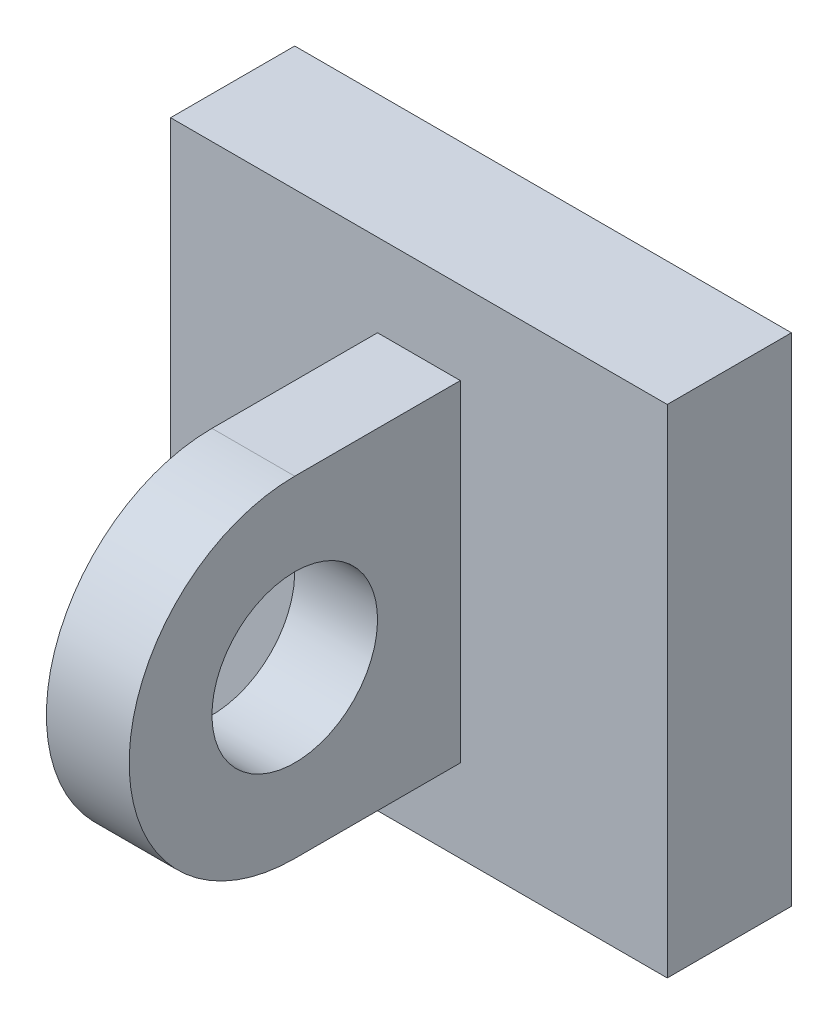
ISO-10303-21;
HEADER;
FILE_DESCRIPTION(('STEP AP214'),'2;1');
FILE_NAME('part.step','',(''),(''),'','','');
FILE_SCHEMA(('AUTOMOTIVE_DESIGN { 1 0 10303 214 1 1 1 1 }'));
ENDSEC;
DATA;
#1=APPLICATION_CONTEXT('core data for automotive mechanical design processes');
#2=APPLICATION_PROTOCOL_DEFINITION('international standard','automotive_design',2000,#1);
#3=PRODUCT_CONTEXT('',#1,'mechanical');
#4=PRODUCT('Part','Part','',(#3));
#5=PRODUCT_RELATED_PRODUCT_CATEGORY('part','',(#4));
#6=PRODUCT_DEFINITION_FORMATION('','',#4);
#7=PRODUCT_DEFINITION_CONTEXT('part definition',#1,'design');
#8=PRODUCT_DEFINITION('design','',#6,#7);
#9=PRODUCT_DEFINITION_SHAPE('','',#8);
#10=(LENGTH_UNIT() NAMED_UNIT(*) SI_UNIT(.MILLI.,.METRE.));
#11=(NAMED_UNIT(*) PLANE_ANGLE_UNIT() SI_UNIT($,.RADIAN.));
#12=(NAMED_UNIT(*) SI_UNIT($,.STERADIAN.) SOLID_ANGLE_UNIT());
#13=UNCERTAINTY_MEASURE_WITH_UNIT(LENGTH_MEASURE(1.E-05),#10,'distance_accuracy_value','');
#14=(GEOMETRIC_REPRESENTATION_CONTEXT(3) GLOBAL_UNCERTAINTY_ASSIGNED_CONTEXT((#13)) GLOBAL_UNIT_ASSIGNED_CONTEXT((#10,
#11,#12)) REPRESENTATION_CONTEXT('',''));
#15=CARTESIAN_POINT('',(0.,0.,0.));
#16=DIRECTION('',(0.,0.,1.));
#17=DIRECTION('',(1.,0.,0.));
#18=AXIS2_PLACEMENT_3D('',#15,#16,#17);
#19=CARTESIAN_POINT('',(0.,0.,7.5));
#20=DIRECTION('',(0.,0.,1.));
#21=DIRECTION('',(1.,0.,0.));
#22=AXIS2_PLACEMENT_3D('',#19,#20,#21);
#23=PLANE('',#22);
#24=DIRECTION('',(0.,1.,0.));
#25=VECTOR('',#24,1.);
#26=CARTESIAN_POINT('',(30.,30.,7.5));
#27=LINE('',#26,#25);
#28=CARTESIAN_POINT('',(30.,-30.,7.5));
#29=VERTEX_POINT('',#28);
#30=CARTESIAN_POINT('',(30.,30.,7.5));
#31=VERTEX_POINT('',#30);
#32=EDGE_CURVE('E155',#29,#31,#27,.T.);
#33=ORIENTED_EDGE('',*,*,#32,.T.);
#34=DIRECTION('',(-1.,0.,0.));
#35=VECTOR('',#34,1.);
#36=CARTESIAN_POINT('',(-30.,30.,7.5));
#37=LINE('',#36,#35);
#38=CARTESIAN_POINT('',(-30.,30.,7.5));
#39=VERTEX_POINT('',#38);
#40=EDGE_CURVE('E94',#31,#39,#37,.T.);
#41=ORIENTED_EDGE('',*,*,#40,.T.);
#42=DIRECTION('',(0.,-1.,0.));
#43=VECTOR('',#42,1.);
#44=CARTESIAN_POINT('',(-30.,30.,7.5));
#45=LINE('',#44,#43);
#46=CARTESIAN_POINT('',(-30.,-30.,7.5));
#47=VERTEX_POINT('',#46);
#48=EDGE_CURVE('E160',#39,#47,#45,.T.);
#49=ORIENTED_EDGE('',*,*,#48,.T.);
#50=DIRECTION('',(1.,0.,0.));
#51=VECTOR('',#50,1.);
#52=CARTESIAN_POINT('',(-30.,-30.,7.5));
#53=LINE('',#52,#51);
#54=EDGE_CURVE('E66',#47,#29,#53,.T.);
#55=ORIENTED_EDGE('',*,*,#54,.T.);
#56=EDGE_LOOP('',(#33,#41,#49,#55));
#57=FACE_BOUND('',#56,.T.);
#58=DIRECTION('',(-1.,0.,0.));
#59=VECTOR('',#58,1.);
#60=CARTESIAN_POINT('',(5.,-20.,7.5));
#61=LINE('',#60,#59);
#62=CARTESIAN_POINT('',(5.,-20.,7.5));
#63=VERTEX_POINT('',#62);
#64=CARTESIAN_POINT('',(-5.,-20.,7.5));
#65=VERTEX_POINT('',#64);
#66=EDGE_CURVE('E124',#63,#65,#61,.T.);
#67=ORIENTED_EDGE('',*,*,#66,.T.);
#68=DIRECTION('',(0.,1.,0.));
#69=VECTOR('',#68,1.);
#70=CARTESIAN_POINT('',(-5.,0.,7.5));
#71=LINE('',#70,#69);
#72=CARTESIAN_POINT('',(-5.,20.,7.50000000000001));
#73=VERTEX_POINT('',#72);
#74=EDGE_CURVE('E57',#65,#73,#71,.T.);
#75=ORIENTED_EDGE('',*,*,#74,.T.);
#76=DIRECTION('',(-1.,0.,0.));
#77=VECTOR('',#76,1.);
#78=CARTESIAN_POINT('',(5.,20.,7.50000000000001));
#79=LINE('',#78,#77);
#80=CARTESIAN_POINT('',(5.,20.,7.50000000000001));
#81=VERTEX_POINT('',#80);
#82=EDGE_CURVE('E151',#81,#73,#79,.T.);
#83=ORIENTED_EDGE('',*,*,#82,.F.);
#84=DIRECTION('',(0.,1.,0.));
#85=VECTOR('',#84,1.);
#86=CARTESIAN_POINT('',(5.,0.,7.5));
#87=LINE('',#86,#85);
#88=EDGE_CURVE('E128',#63,#81,#87,.T.);
#89=ORIENTED_EDGE('',*,*,#88,.F.);
#90=EDGE_LOOP('',(#67,#75,#83,#89));
#91=FACE_BOUND('',#90,.T.);
#92=ADVANCED_FACE('F41',(#57,#91),#23,.T.);
#93=CARTESIAN_POINT('',(30.,30.,7.5));
#94=DIRECTION('',(-1.,0.,0.));
#95=DIRECTION('',(0.,-1.,0.));
#96=AXIS2_PLACEMENT_3D('',#93,#94,#95);
#97=PLANE('',#96);
#98=DIRECTION('',(0.,1.,0.));
#99=VECTOR('',#98,1.);
#100=CARTESIAN_POINT('',(30.,30.,-7.5));
#101=LINE('',#100,#99);
#102=CARTESIAN_POINT('',(30.,-30.,-7.5));
#103=VERTEX_POINT('',#102);
#104=CARTESIAN_POINT('',(30.,30.,-7.5));
#105=VERTEX_POINT('',#104);
#106=EDGE_CURVE('E144',#103,#105,#101,.T.);
#107=ORIENTED_EDGE('',*,*,#106,.T.);
#108=DIRECTION('',(0.,0.,-1.));
#109=VECTOR('',#108,1.);
#110=CARTESIAN_POINT('',(30.,30.,7.5));
#111=LINE('',#110,#109);
#112=EDGE_CURVE('E11',#31,#105,#111,.T.);
#113=ORIENTED_EDGE('',*,*,#112,.F.);
#114=ORIENTED_EDGE('',*,*,#32,.F.);
#115=DIRECTION('',(0.,0.,-1.));
#116=VECTOR('',#115,1.);
#117=CARTESIAN_POINT('',(30.,-30.,7.5));
#118=LINE('',#117,#116);
#119=EDGE_CURVE('E164',#29,#103,#118,.T.);
#120=ORIENTED_EDGE('',*,*,#119,.T.);
#121=EDGE_LOOP('',(#107,#113,#114,#120));
#122=FACE_BOUND('',#121,.T.);
#123=ADVANCED_FACE('F43',(#122),#97,.F.);
#124=CARTESIAN_POINT('',(-30.,30.,7.5));
#125=DIRECTION('',(0.,-1.,0.));
#126=DIRECTION('',(0.,0.,-1.));
#127=AXIS2_PLACEMENT_3D('',#124,#125,#126);
#128=PLANE('',#127);
#129=DIRECTION('',(-1.,0.,0.));
#130=VECTOR('',#129,1.);
#131=CARTESIAN_POINT('',(-30.,30.,-7.5));
#132=LINE('',#131,#130);
#133=CARTESIAN_POINT('',(-30.,30.,-7.5));
#134=VERTEX_POINT('',#133);
#135=EDGE_CURVE('E149',#105,#134,#132,.T.);
#136=ORIENTED_EDGE('',*,*,#135,.T.);
#137=DIRECTION('',(0.,0.,-1.));
#138=VECTOR('',#137,1.);
#139=CARTESIAN_POINT('',(-30.,30.,7.5));
#140=LINE('',#139,#138);
#141=EDGE_CURVE('E50',#39,#134,#140,.T.);
#142=ORIENTED_EDGE('',*,*,#141,.F.);
#143=ORIENTED_EDGE('',*,*,#40,.F.);
#144=ORIENTED_EDGE('',*,*,#112,.T.);
#145=EDGE_LOOP('',(#136,#142,#143,#144));
#146=FACE_BOUND('',#145,.T.);
#147=ADVANCED_FACE('F198',(#146),#128,.F.);
#148=CARTESIAN_POINT('',(-30.,30.,7.5));
#149=DIRECTION('',(1.,0.,0.));
#150=DIRECTION('',(0.,1.,0.));
#151=AXIS2_PLACEMENT_3D('',#148,#149,#150);
#152=PLANE('',#151);
#153=DIRECTION('',(0.,-1.,0.));
#154=VECTOR('',#153,1.);
#155=CARTESIAN_POINT('',(-30.,30.,-7.5));
#156=LINE('',#155,#154);
#157=CARTESIAN_POINT('',(-30.,-30.,-7.5));
#158=VERTEX_POINT('',#157);
#159=EDGE_CURVE('E168',#134,#158,#156,.T.);
#160=ORIENTED_EDGE('',*,*,#159,.T.);
#161=DIRECTION('',(0.,0.,-1.));
#162=VECTOR('',#161,1.);
#163=CARTESIAN_POINT('',(-30.,-30.,7.5));
#164=LINE('',#163,#162);
#165=EDGE_CURVE('E175',#47,#158,#164,.T.);
#166=ORIENTED_EDGE('',*,*,#165,.F.);
#167=ORIENTED_EDGE('',*,*,#48,.F.);
#168=ORIENTED_EDGE('',*,*,#141,.T.);
#169=EDGE_LOOP('',(#160,#166,#167,#168));
#170=FACE_BOUND('',#169,.T.);
#171=ADVANCED_FACE('F182',(#170),#152,.F.);
#172=CARTESIAN_POINT('',(-30.,-30.,7.5));
#173=DIRECTION('',(0.,1.,0.));
#174=DIRECTION('',(0.,0.,1.));
#175=AXIS2_PLACEMENT_3D('',#172,#173,#174);
#176=PLANE('',#175);
#177=DIRECTION('',(1.,0.,0.));
#178=VECTOR('',#177,1.);
#179=CARTESIAN_POINT('',(-30.,-30.,-7.5));
#180=LINE('',#179,#178);
#181=EDGE_CURVE('E87',#158,#103,#180,.T.);
#182=ORIENTED_EDGE('',*,*,#181,.T.);
#183=ORIENTED_EDGE('',*,*,#119,.F.);
#184=ORIENTED_EDGE('',*,*,#54,.F.);
#185=ORIENTED_EDGE('',*,*,#165,.T.);
#186=EDGE_LOOP('',(#182,#183,#184,#185));
#187=FACE_BOUND('',#186,.T.);
#188=ADVANCED_FACE('F190',(#187),#176,.F.);
#189=CARTESIAN_POINT('',(0.,0.,-7.5));
#190=DIRECTION('',(0.,0.,1.));
#191=DIRECTION('',(1.,0.,0.));
#192=AXIS2_PLACEMENT_3D('',#189,#190,#191);
#193=PLANE('',#192);
#194=ORIENTED_EDGE('',*,*,#106,.F.);
#195=ORIENTED_EDGE('',*,*,#181,.F.);
#196=ORIENTED_EDGE('',*,*,#159,.F.);
#197=ORIENTED_EDGE('',*,*,#135,.F.);
#198=EDGE_LOOP('',(#194,#195,#196,#197));
#199=FACE_BOUND('',#198,.T.);
#200=ADVANCED_FACE('F186',(#199),#193,.F.);
#201=CARTESIAN_POINT('',(5.,0.,27.5));
#202=DIRECTION('',(-1.,0.,0.));
#203=DIRECTION('',(0.,-1.,0.));
#204=AXIS2_PLACEMENT_3D('',#201,#202,#203);
#205=CYLINDRICAL_SURFACE('',#204,20.);
#206=CARTESIAN_POINT('',(-5.,0.,27.5));
#207=DIRECTION('',(1.,0.,0.));
#208=DIRECTION('',(0.,1.,0.));
#209=AXIS2_PLACEMENT_3D('',#206,#207,#208);
#210=CIRCLE('',#209,20.);
#211=CARTESIAN_POINT('',(-5.,20.,27.5));
#212=VERTEX_POINT('',#211);
#213=CARTESIAN_POINT('',(-5.,-20.,27.5));
#214=VERTEX_POINT('',#213);
#215=EDGE_CURVE('E142',#212,#214,#210,.T.);
#216=ORIENTED_EDGE('',*,*,#215,.T.);
#217=DIRECTION('',(-1.,0.,0.));
#218=VECTOR('',#217,1.);
#219=CARTESIAN_POINT('',(5.,-20.,27.5));
#220=LINE('',#219,#218);
#221=CARTESIAN_POINT('',(5.,-20.,27.5));
#222=VERTEX_POINT('',#221);
#223=EDGE_CURVE('E121',#222,#214,#220,.T.);
#224=ORIENTED_EDGE('',*,*,#223,.F.);
#225=CARTESIAN_POINT('',(5.,0.,27.5));
#226=DIRECTION('',(1.,0.,0.));
#227=DIRECTION('',(0.,1.,0.));
#228=AXIS2_PLACEMENT_3D('',#225,#226,#227);
#229=CIRCLE('',#228,20.);
#230=CARTESIAN_POINT('',(5.,20.,27.5));
#231=VERTEX_POINT('',#230);
#232=EDGE_CURVE('E129',#231,#222,#229,.T.);
#233=ORIENTED_EDGE('',*,*,#232,.F.);
#234=DIRECTION('',(-1.,0.,0.));
#235=VECTOR('',#234,1.);
#236=CARTESIAN_POINT('',(5.,20.,27.5));
#237=LINE('',#236,#235);
#238=EDGE_CURVE('E239',#231,#212,#237,.T.);
#239=ORIENTED_EDGE('',*,*,#238,.T.);
#240=EDGE_LOOP('',(#216,#224,#233,#239));
#241=FACE_BOUND('',#240,.T.);
#242=ADVANCED_FACE('F140',(#241),#205,.T.);
#243=CARTESIAN_POINT('',(5.,-20.,0.));
#244=DIRECTION('',(0.,1.,0.));
#245=DIRECTION('',(0.,0.,1.));
#246=AXIS2_PLACEMENT_3D('',#243,#244,#245);
#247=PLANE('',#246);
#248=DIRECTION('',(0.,0.,-1.));
#249=VECTOR('',#248,1.);
#250=CARTESIAN_POINT('',(-5.,-20.,0.));
#251=LINE('',#250,#249);
#252=EDGE_CURVE('E246',#214,#65,#251,.T.);
#253=ORIENTED_EDGE('',*,*,#252,.T.);
#254=ORIENTED_EDGE('',*,*,#66,.F.);
#255=DIRECTION('',(0.,0.,-1.));
#256=VECTOR('',#255,1.);
#257=CARTESIAN_POINT('',(5.,-20.,0.));
#258=LINE('',#257,#256);
#259=EDGE_CURVE('E117',#222,#63,#258,.T.);
#260=ORIENTED_EDGE('',*,*,#259,.F.);
#261=ORIENTED_EDGE('',*,*,#223,.T.);
#262=EDGE_LOOP('',(#253,#254,#260,#261));
#263=FACE_BOUND('',#262,.T.);
#264=ADVANCED_FACE('F119',(#263),#247,.F.);
#265=CARTESIAN_POINT('',(5.,0.,27.5));
#266=DIRECTION('',(-1.,0.,0.));
#267=DIRECTION('',(0.,-1.,0.));
#268=AXIS2_PLACEMENT_3D('',#265,#266,#267);
#269=CYLINDRICAL_SURFACE('',#268,10.);
#270=CARTESIAN_POINT('',(5.,0.,27.5));
#271=DIRECTION('',(1.,0.,0.));
#272=DIRECTION('',(0.,1.,0.));
#273=AXIS2_PLACEMENT_3D('',#270,#271,#272);
#274=CIRCLE('',#273,10.);
#275=CARTESIAN_POINT('',(5.,9.99999999999999,27.5));
#276=VERTEX_POINT('',#275);
#277=EDGE_CURVE('E138',#276,#276,#274,.T.);
#278=ORIENTED_EDGE('',*,*,#277,.T.);
#279=EDGE_LOOP('',(#278));
#280=FACE_BOUND('',#279,.T.);
#281=CARTESIAN_POINT('',(-5.,0.,27.5));
#282=DIRECTION('',(1.,0.,0.));
#283=DIRECTION('',(0.,1.,0.));
#284=AXIS2_PLACEMENT_3D('',#281,#282,#283);
#285=CIRCLE('',#284,10.);
#286=CARTESIAN_POINT('',(-5.,9.99999999999999,27.5));
#287=VERTEX_POINT('',#286);
#288=EDGE_CURVE('E240',#287,#287,#285,.T.);
#289=ORIENTED_EDGE('',*,*,#288,.F.);
#290=EDGE_LOOP('',(#289));
#291=FACE_BOUND('',#290,.T.);
#292=ADVANCED_FACE('F207',(#280,#291),#269,.F.);
#293=CARTESIAN_POINT('',(5.,20.,0.));
#294=DIRECTION('',(0.,1.,0.));
#295=DIRECTION('',(0.,0.,1.));
#296=AXIS2_PLACEMENT_3D('',#293,#294,#295);
#297=PLANE('',#296);
#298=DIRECTION('',(0.,0.,-1.));
#299=VECTOR('',#298,1.);
#300=CARTESIAN_POINT('',(-5.,20.,0.));
#301=LINE('',#300,#299);
#302=EDGE_CURVE('E230',#212,#73,#301,.T.);
#303=ORIENTED_EDGE('',*,*,#302,.F.);
#304=ORIENTED_EDGE('',*,*,#238,.F.);
#305=DIRECTION('',(0.,0.,-1.));
#306=VECTOR('',#305,1.);
#307=CARTESIAN_POINT('',(5.,20.,0.));
#308=LINE('',#307,#306);
#309=EDGE_CURVE('E135',#231,#81,#308,.T.);
#310=ORIENTED_EDGE('',*,*,#309,.T.);
#311=ORIENTED_EDGE('',*,*,#82,.T.);
#312=EDGE_LOOP('',(#303,#304,#310,#311));
#313=FACE_BOUND('',#312,.T.);
#314=ADVANCED_FACE('F210',(#313),#297,.T.);
#315=CARTESIAN_POINT('',(5.,0.,0.));
#316=DIRECTION('',(1.,0.,0.));
#317=DIRECTION('',(0.,1.,0.));
#318=AXIS2_PLACEMENT_3D('',#315,#316,#317);
#319=PLANE('',#318);
#320=ORIENTED_EDGE('',*,*,#277,.F.);
#321=EDGE_LOOP('',(#320));
#322=FACE_BOUND('',#321,.T.);
#323=ORIENTED_EDGE('',*,*,#232,.T.);
#324=ORIENTED_EDGE('',*,*,#259,.T.);
#325=ORIENTED_EDGE('',*,*,#88,.T.);
#326=ORIENTED_EDGE('',*,*,#309,.F.);
#327=EDGE_LOOP('',(#323,#324,#325,#326));
#328=FACE_BOUND('',#327,.T.);
#329=ADVANCED_FACE('F133',(#322,#328),#319,.T.);
#330=CARTESIAN_POINT('',(-5.,0.,0.));
#331=DIRECTION('',(1.,0.,0.));
#332=DIRECTION('',(0.,1.,0.));
#333=AXIS2_PLACEMENT_3D('',#330,#331,#332);
#334=PLANE('',#333);
#335=ORIENTED_EDGE('',*,*,#288,.T.);
#336=EDGE_LOOP('',(#335));
#337=FACE_BOUND('',#336,.T.);
#338=ORIENTED_EDGE('',*,*,#215,.F.);
#339=ORIENTED_EDGE('',*,*,#302,.T.);
#340=ORIENTED_EDGE('',*,*,#74,.F.);
#341=ORIENTED_EDGE('',*,*,#252,.F.);
#342=EDGE_LOOP('',(#338,#339,#340,#341));
#343=FACE_BOUND('',#342,.T.);
#344=ADVANCED_FACE('F219',(#337,#343),#334,.F.);
#345=CLOSED_SHELL('',(#92,#123,#147,#171,#188,#200,#242,#264,#292,#314,#329,#344));
#346=MANIFOLD_SOLID_BREP('B2',#345);
#347=ADVANCED_BREP_SHAPE_REPRESENTATION('',(#18,#346),#14);
#348=SHAPE_DEFINITION_REPRESENTATION(#9,#347);
ENDSEC;
END-ISO-10303-21;
